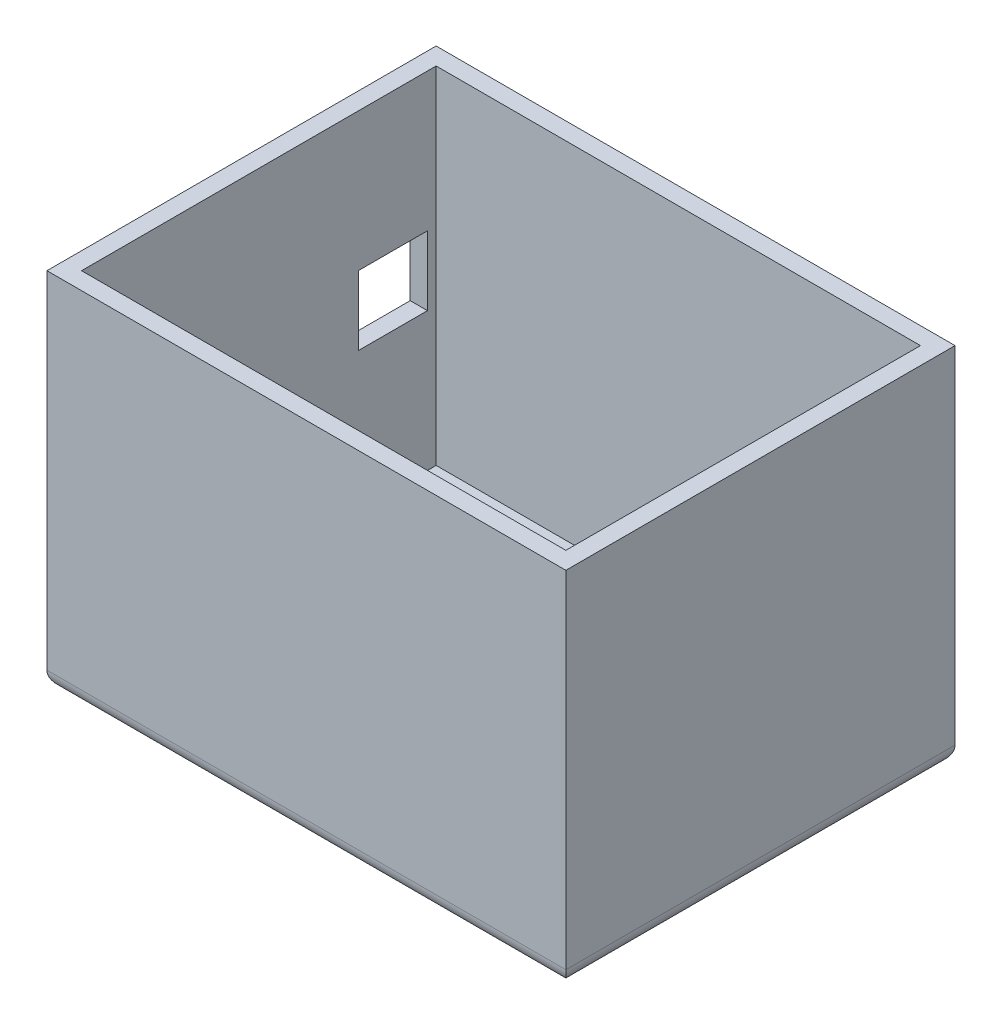
ISO-10303-21;
HEADER;
FILE_DESCRIPTION(('STEP AP214'),'2;1');
FILE_NAME('part.step','',(''),(''),'','','');
FILE_SCHEMA(('AUTOMOTIVE_DESIGN { 1 0 10303 214 1 1 1 1 }'));
ENDSEC;
DATA;
#1=APPLICATION_CONTEXT('core data for automotive mechanical design processes');
#2=APPLICATION_PROTOCOL_DEFINITION('international standard','automotive_design',2000,#1);
#3=PRODUCT_CONTEXT('',#1,'mechanical');
#4=PRODUCT('Part','Part','',(#3));
#5=PRODUCT_RELATED_PRODUCT_CATEGORY('part','',(#4));
#6=PRODUCT_DEFINITION_FORMATION('','',#4);
#7=PRODUCT_DEFINITION_CONTEXT('part definition',#1,'design');
#8=PRODUCT_DEFINITION('design','',#6,#7);
#9=PRODUCT_DEFINITION_SHAPE('','',#8);
#10=(LENGTH_UNIT() NAMED_UNIT(*) SI_UNIT(.MILLI.,.METRE.));
#11=(NAMED_UNIT(*) PLANE_ANGLE_UNIT() SI_UNIT($,.RADIAN.));
#12=(NAMED_UNIT(*) SI_UNIT($,.STERADIAN.) SOLID_ANGLE_UNIT());
#13=UNCERTAINTY_MEASURE_WITH_UNIT(LENGTH_MEASURE(1.E-05),#10,'distance_accuracy_value','');
#14=(GEOMETRIC_REPRESENTATION_CONTEXT(3) GLOBAL_UNCERTAINTY_ASSIGNED_CONTEXT((#13)) GLOBAL_UNIT_ASSIGNED_CONTEXT((#10,
#11,#12)) REPRESENTATION_CONTEXT('',''));
#15=CARTESIAN_POINT('',(0.,0.,0.));
#16=DIRECTION('',(0.,0.,1.));
#17=DIRECTION('',(1.,0.,0.));
#18=AXIS2_PLACEMENT_3D('',#15,#16,#17);
#19=CARTESIAN_POINT('',(0.,400.,0.));
#20=DIRECTION('',(0.,1.,0.));
#21=DIRECTION('',(0.,0.,1.));
#22=AXIS2_PLACEMENT_3D('',#19,#20,#21);
#23=PLANE('',#22);
#24=DIRECTION('',(1.,0.,0.));
#25=VECTOR('',#24,1.);
#26=CARTESIAN_POINT('',(-300.,400.,225.));
#27=LINE('',#26,#25);
#28=CARTESIAN_POINT('',(-300.,400.,225.));
#29=VERTEX_POINT('',#28);
#30=CARTESIAN_POINT('',(300.,400.,225.));
#31=VERTEX_POINT('',#30);
#32=EDGE_CURVE('E259',#29,#31,#27,.T.);
#33=ORIENTED_EDGE('',*,*,#32,.T.);
#34=DIRECTION('',(0.,0.,-1.));
#35=VECTOR('',#34,1.);
#36=CARTESIAN_POINT('',(300.,400.,225.));
#37=LINE('',#36,#35);
#38=CARTESIAN_POINT('',(300.,400.,-225.));
#39=VERTEX_POINT('',#38);
#40=EDGE_CURVE('E262',#31,#39,#37,.T.);
#41=ORIENTED_EDGE('',*,*,#40,.T.);
#42=DIRECTION('',(-1.,0.,0.));
#43=VECTOR('',#42,1.);
#44=CARTESIAN_POINT('',(-300.,400.,-225.));
#45=LINE('',#44,#43);
#46=CARTESIAN_POINT('',(-300.,400.,-225.));
#47=VERTEX_POINT('',#46);
#48=EDGE_CURVE('E264',#39,#47,#45,.T.);
#49=ORIENTED_EDGE('',*,*,#48,.T.);
#50=DIRECTION('',(0.,0.,1.));
#51=VECTOR('',#50,1.);
#52=CARTESIAN_POINT('',(-300.,400.,225.));
#53=LINE('',#52,#51);
#54=EDGE_CURVE('E266',#47,#29,#53,.T.);
#55=ORIENTED_EDGE('',*,*,#54,.T.);
#56=EDGE_LOOP('',(#33,#41,#49,#55));
#57=FACE_BOUND('',#56,.T.);
#58=DIRECTION('',(-1.,0.,0.));
#59=VECTOR('',#58,1.);
#60=CARTESIAN_POINT('',(-280.,400.,-205.));
#61=LINE('',#60,#59);
#62=CARTESIAN_POINT('',(280.,400.,-205.));
#63=VERTEX_POINT('',#62);
#64=CARTESIAN_POINT('',(-280.,400.,-205.));
#65=VERTEX_POINT('',#64);
#66=EDGE_CURVE('E231',#63,#65,#61,.T.);
#67=ORIENTED_EDGE('',*,*,#66,.F.);
#68=DIRECTION('',(0.,0.,-1.));
#69=VECTOR('',#68,1.);
#70=CARTESIAN_POINT('',(280.,400.,205.));
#71=LINE('',#70,#69);
#72=CARTESIAN_POINT('',(280.,400.,205.));
#73=VERTEX_POINT('',#72);
#74=EDGE_CURVE('E229',#73,#63,#71,.T.);
#75=ORIENTED_EDGE('',*,*,#74,.F.);
#76=DIRECTION('',(1.,0.,0.));
#77=VECTOR('',#76,1.);
#78=CARTESIAN_POINT('',(-280.,400.,205.));
#79=LINE('',#78,#77);
#80=CARTESIAN_POINT('',(-280.,400.,205.));
#81=VERTEX_POINT('',#80);
#82=EDGE_CURVE('E237',#81,#73,#79,.T.);
#83=ORIENTED_EDGE('',*,*,#82,.F.);
#84=DIRECTION('',(0.,0.,1.));
#85=VECTOR('',#84,1.);
#86=CARTESIAN_POINT('',(-280.,400.,205.));
#87=LINE('',#86,#85);
#88=EDGE_CURVE('E234',#65,#81,#87,.T.);
#89=ORIENTED_EDGE('',*,*,#88,.F.);
#90=EDGE_LOOP('',(#67,#75,#83,#89));
#91=FACE_BOUND('',#90,.T.);
#92=ADVANCED_FACE('F33',(#57,#91),#23,.T.);
#93=CARTESIAN_POINT('',(-300.,400.,225.));
#94=DIRECTION('',(0.,0.,-1.));
#95=DIRECTION('',(-1.,0.,0.));
#96=AXIS2_PLACEMENT_3D('',#93,#94,#95);
#97=PLANE('',#96);
#98=DIRECTION('',(0.,-1.,0.));
#99=VECTOR('',#98,1.);
#100=CARTESIAN_POINT('',(-300.,400.,225.));
#101=LINE('',#100,#99);
#102=CARTESIAN_POINT('',(-300.,0.,225.));
#103=VERTEX_POINT('',#102);
#104=EDGE_CURVE('E268',#29,#103,#101,.T.);
#105=ORIENTED_EDGE('',*,*,#104,.T.);
#106=DIRECTION('',(-1.,0.,0.));
#107=VECTOR('',#106,1.);
#108=CARTESIAN_POINT('',(-300.,0.,225.));
#109=LINE('',#108,#107);
#110=CARTESIAN_POINT('',(300.,0.,225.));
#111=VERTEX_POINT('',#110);
#112=EDGE_CURVE('E42',#103,#111,#109,.F.);
#113=ORIENTED_EDGE('',*,*,#112,.T.);
#114=DIRECTION('',(0.,-1.,0.));
#115=VECTOR('',#114,1.);
#116=CARTESIAN_POINT('',(300.,400.,225.));
#117=LINE('',#116,#115);
#118=EDGE_CURVE('E277',#31,#111,#117,.T.);
#119=ORIENTED_EDGE('',*,*,#118,.F.);
#120=ORIENTED_EDGE('',*,*,#32,.F.);
#121=EDGE_LOOP('',(#105,#113,#119,#120));
#122=FACE_BOUND('',#121,.T.);
#123=ADVANCED_FACE('F315',(#122),#97,.F.);
#124=CARTESIAN_POINT('',(300.,400.,225.));
#125=DIRECTION('',(-1.,0.,0.));
#126=DIRECTION('',(0.,0.,1.));
#127=AXIS2_PLACEMENT_3D('',#124,#125,#126);
#128=PLANE('',#127);
#129=ORIENTED_EDGE('',*,*,#118,.T.);
#130=DIRECTION('',(0.,0.,1.));
#131=VECTOR('',#130,1.);
#132=CARTESIAN_POINT('',(300.,0.,225.));
#133=LINE('',#132,#131);
#134=CARTESIAN_POINT('',(300.,0.,-225.));
#135=VERTEX_POINT('',#134);
#136=EDGE_CURVE('E11',#111,#135,#133,.F.);
#137=ORIENTED_EDGE('',*,*,#136,.T.);
#138=DIRECTION('',(0.,-1.,0.));
#139=VECTOR('',#138,1.);
#140=CARTESIAN_POINT('',(300.,400.,-225.));
#141=LINE('',#140,#139);
#142=EDGE_CURVE('E274',#39,#135,#141,.T.);
#143=ORIENTED_EDGE('',*,*,#142,.F.);
#144=ORIENTED_EDGE('',*,*,#40,.F.);
#145=EDGE_LOOP('',(#129,#137,#143,#144));
#146=FACE_BOUND('',#145,.T.);
#147=ADVANCED_FACE('F319',(#146),#128,.F.);
#148=CARTESIAN_POINT('',(-300.,400.,-225.));
#149=DIRECTION('',(0.,0.,1.));
#150=DIRECTION('',(1.,0.,0.));
#151=AXIS2_PLACEMENT_3D('',#148,#149,#150);
#152=PLANE('',#151);
#153=ORIENTED_EDGE('',*,*,#142,.T.);
#154=DIRECTION('',(1.,0.,0.));
#155=VECTOR('',#154,1.);
#156=CARTESIAN_POINT('',(-300.,0.,-225.));
#157=LINE('',#156,#155);
#158=CARTESIAN_POINT('',(-300.,0.,-225.));
#159=VERTEX_POINT('',#158);
#160=EDGE_CURVE('E289',#135,#159,#157,.F.);
#161=ORIENTED_EDGE('',*,*,#160,.T.);
#162=DIRECTION('',(0.,-1.,0.));
#163=VECTOR('',#162,1.);
#164=CARTESIAN_POINT('',(-300.,400.,-225.));
#165=LINE('',#164,#163);
#166=EDGE_CURVE('E271',#47,#159,#165,.T.);
#167=ORIENTED_EDGE('',*,*,#166,.F.);
#168=ORIENTED_EDGE('',*,*,#48,.F.);
#169=EDGE_LOOP('',(#153,#161,#167,#168));
#170=FACE_BOUND('',#169,.T.);
#171=ADVANCED_FACE('F329',(#170),#152,.F.);
#172=CARTESIAN_POINT('',(-300.,400.,225.));
#173=DIRECTION('',(1.,0.,0.));
#174=DIRECTION('',(0.,0.,-1.));
#175=AXIS2_PLACEMENT_3D('',#172,#173,#174);
#176=PLANE('',#175);
#177=DIRECTION('',(0.,-1.,0.));
#178=VECTOR('',#177,1.);
#179=CARTESIAN_POINT('',(-300.,240.,-195.));
#180=LINE('',#179,#178);
#181=CARTESIAN_POINT('',(-300.,240.,-195.));
#182=VERTEX_POINT('',#181);
#183=CARTESIAN_POINT('',(-300.,160.,-195.));
#184=VERTEX_POINT('',#183);
#185=EDGE_CURVE('E183',#182,#184,#180,.T.);
#186=ORIENTED_EDGE('',*,*,#185,.F.);
#187=DIRECTION('',(0.,0.,-1.));
#188=VECTOR('',#187,1.);
#189=CARTESIAN_POINT('',(-300.,240.,-195.));
#190=LINE('',#189,#188);
#191=CARTESIAN_POINT('',(-300.,240.,-115.));
#192=VERTEX_POINT('',#191);
#193=EDGE_CURVE('E176',#192,#182,#190,.T.);
#194=ORIENTED_EDGE('',*,*,#193,.F.);
#195=DIRECTION('',(0.,1.,0.));
#196=VECTOR('',#195,1.);
#197=CARTESIAN_POINT('',(-300.,240.,-115.));
#198=LINE('',#197,#196);
#199=CARTESIAN_POINT('',(-300.,160.,-115.));
#200=VERTEX_POINT('',#199);
#201=EDGE_CURVE('E187',#200,#192,#198,.T.);
#202=ORIENTED_EDGE('',*,*,#201,.F.);
#203=DIRECTION('',(0.,0.,1.));
#204=VECTOR('',#203,1.);
#205=CARTESIAN_POINT('',(-300.,160.,-195.));
#206=LINE('',#205,#204);
#207=EDGE_CURVE('E50',#184,#200,#206,.T.);
#208=ORIENTED_EDGE('',*,*,#207,.F.);
#209=EDGE_LOOP('',(#186,#194,#202,#208));
#210=FACE_BOUND('',#209,.T.);
#211=DIRECTION('',(0.,-1.,0.));
#212=VECTOR('',#211,1.);
#213=CARTESIAN_POINT('',(-300.,240.,115.));
#214=LINE('',#213,#212);
#215=CARTESIAN_POINT('',(-300.,240.,115.));
#216=VERTEX_POINT('',#215);
#217=CARTESIAN_POINT('',(-300.,160.,115.));
#218=VERTEX_POINT('',#217);
#219=EDGE_CURVE('E200',#216,#218,#214,.T.);
#220=ORIENTED_EDGE('',*,*,#219,.F.);
#221=DIRECTION('',(0.,0.,-1.));
#222=VECTOR('',#221,1.);
#223=CARTESIAN_POINT('',(-300.,240.,115.));
#224=LINE('',#223,#222);
#225=CARTESIAN_POINT('',(-300.,240.,195.));
#226=VERTEX_POINT('',#225);
#227=EDGE_CURVE('E203',#226,#216,#224,.T.);
#228=ORIENTED_EDGE('',*,*,#227,.F.);
#229=DIRECTION('',(0.,1.,0.));
#230=VECTOR('',#229,1.);
#231=CARTESIAN_POINT('',(-300.,240.,195.));
#232=LINE('',#231,#230);
#233=CARTESIAN_POINT('',(-300.,160.,195.));
#234=VERTEX_POINT('',#233);
#235=EDGE_CURVE('E196',#234,#226,#232,.T.);
#236=ORIENTED_EDGE('',*,*,#235,.F.);
#237=DIRECTION('',(0.,0.,1.));
#238=VECTOR('',#237,1.);
#239=CARTESIAN_POINT('',(-300.,160.,115.));
#240=LINE('',#239,#238);
#241=EDGE_CURVE('E197',#218,#234,#240,.T.);
#242=ORIENTED_EDGE('',*,*,#241,.F.);
#243=EDGE_LOOP('',(#220,#228,#236,#242));
#244=FACE_BOUND('',#243,.T.);
#245=ORIENTED_EDGE('',*,*,#166,.T.);
#246=DIRECTION('',(0.,0.,-1.));
#247=VECTOR('',#246,1.);
#248=CARTESIAN_POINT('',(-300.,0.,225.));
#249=LINE('',#248,#247);
#250=EDGE_CURVE('E292',#159,#103,#249,.F.);
#251=ORIENTED_EDGE('',*,*,#250,.T.);
#252=ORIENTED_EDGE('',*,*,#104,.F.);
#253=ORIENTED_EDGE('',*,*,#54,.F.);
#254=EDGE_LOOP('',(#245,#251,#252,#253));
#255=FACE_BOUND('',#254,.T.);
#256=ADVANCED_FACE('F327',(#210,#244,#255),#176,.F.);
#257=CARTESIAN_POINT('',(280.,400.,205.));
#258=DIRECTION('',(-1.,0.,0.));
#259=DIRECTION('',(0.,0.,1.));
#260=AXIS2_PLACEMENT_3D('',#257,#258,#259);
#261=PLANE('',#260);
#262=DIRECTION('',(0.,0.,-1.));
#263=VECTOR('',#262,1.);
#264=CARTESIAN_POINT('',(280.,0.,205.));
#265=LINE('',#264,#263);
#266=CARTESIAN_POINT('',(280.,0.,205.));
#267=VERTEX_POINT('',#266);
#268=CARTESIAN_POINT('',(280.,0.,-205.));
#269=VERTEX_POINT('',#268);
#270=EDGE_CURVE('E240',#267,#269,#265,.T.);
#271=ORIENTED_EDGE('',*,*,#270,.F.);
#272=DIRECTION('',(0.,-1.,0.));
#273=VECTOR('',#272,1.);
#274=CARTESIAN_POINT('',(280.,400.,205.));
#275=LINE('',#274,#273);
#276=EDGE_CURVE('E239',#73,#267,#275,.T.);
#277=ORIENTED_EDGE('',*,*,#276,.F.);
#278=ORIENTED_EDGE('',*,*,#74,.T.);
#279=DIRECTION('',(0.,-1.,0.));
#280=VECTOR('',#279,1.);
#281=CARTESIAN_POINT('',(280.,400.,-205.));
#282=LINE('',#281,#280);
#283=EDGE_CURVE('E256',#63,#269,#282,.T.);
#284=ORIENTED_EDGE('',*,*,#283,.T.);
#285=EDGE_LOOP('',(#271,#277,#278,#284));
#286=FACE_BOUND('',#285,.T.);
#287=ADVANCED_FACE('F360',(#286),#261,.T.);
#288=CARTESIAN_POINT('',(-280.,400.,-205.));
#289=DIRECTION('',(0.,0.,1.));
#290=DIRECTION('',(1.,0.,0.));
#291=AXIS2_PLACEMENT_3D('',#288,#289,#290);
#292=PLANE('',#291);
#293=DIRECTION('',(-1.,0.,0.));
#294=VECTOR('',#293,1.);
#295=CARTESIAN_POINT('',(-280.,0.,-205.));
#296=LINE('',#295,#294);
#297=CARTESIAN_POINT('',(-280.,0.,-205.));
#298=VERTEX_POINT('',#297);
#299=EDGE_CURVE('E243',#269,#298,#296,.T.);
#300=ORIENTED_EDGE('',*,*,#299,.F.);
#301=ORIENTED_EDGE('',*,*,#283,.F.);
#302=ORIENTED_EDGE('',*,*,#66,.T.);
#303=DIRECTION('',(0.,-1.,0.));
#304=VECTOR('',#303,1.);
#305=CARTESIAN_POINT('',(-280.,400.,-205.));
#306=LINE('',#305,#304);
#307=EDGE_CURVE('E254',#65,#298,#306,.T.);
#308=ORIENTED_EDGE('',*,*,#307,.T.);
#309=EDGE_LOOP('',(#300,#301,#302,#308));
#310=FACE_BOUND('',#309,.T.);
#311=ADVANCED_FACE('F526',(#310),#292,.T.);
#312=CARTESIAN_POINT('',(-280.,400.,205.));
#313=DIRECTION('',(1.,0.,0.));
#314=DIRECTION('',(0.,0.,-1.));
#315=AXIS2_PLACEMENT_3D('',#312,#313,#314);
#316=PLANE('',#315);
#317=DIRECTION('',(0.,0.,-1.));
#318=VECTOR('',#317,1.);
#319=CARTESIAN_POINT('',(-280.,240.,-195.));
#320=LINE('',#319,#318);
#321=CARTESIAN_POINT('',(-280.,240.,-115.));
#322=VERTEX_POINT('',#321);
#323=CARTESIAN_POINT('',(-280.,240.,-195.));
#324=VERTEX_POINT('',#323);
#325=EDGE_CURVE('E173',#322,#324,#320,.T.);
#326=ORIENTED_EDGE('',*,*,#325,.T.);
#327=DIRECTION('',(0.,-1.,0.));
#328=VECTOR('',#327,1.);
#329=CARTESIAN_POINT('',(-280.,240.,-195.));
#330=LINE('',#329,#328);
#331=CARTESIAN_POINT('',(-280.,160.,-195.));
#332=VERTEX_POINT('',#331);
#333=EDGE_CURVE('E160',#324,#332,#330,.T.);
#334=ORIENTED_EDGE('',*,*,#333,.T.);
#335=DIRECTION('',(0.,0.,1.));
#336=VECTOR('',#335,1.);
#337=CARTESIAN_POINT('',(-280.,160.,-195.));
#338=LINE('',#337,#336);
#339=CARTESIAN_POINT('',(-280.,160.,-115.));
#340=VERTEX_POINT('',#339);
#341=EDGE_CURVE('E191',#332,#340,#338,.T.);
#342=ORIENTED_EDGE('',*,*,#341,.T.);
#343=DIRECTION('',(0.,1.,0.));
#344=VECTOR('',#343,1.);
#345=CARTESIAN_POINT('',(-280.,240.,-115.));
#346=LINE('',#345,#344);
#347=EDGE_CURVE('E181',#340,#322,#346,.T.);
#348=ORIENTED_EDGE('',*,*,#347,.T.);
#349=EDGE_LOOP('',(#326,#334,#342,#348));
#350=FACE_BOUND('',#349,.T.);
#351=DIRECTION('',(0.,0.,-1.));
#352=VECTOR('',#351,1.);
#353=CARTESIAN_POINT('',(-280.,240.,115.));
#354=LINE('',#353,#352);
#355=CARTESIAN_POINT('',(-280.,240.,195.));
#356=VERTEX_POINT('',#355);
#357=CARTESIAN_POINT('',(-280.,240.,115.));
#358=VERTEX_POINT('',#357);
#359=EDGE_CURVE('E199',#356,#358,#354,.T.);
#360=ORIENTED_EDGE('',*,*,#359,.T.);
#361=DIRECTION('',(0.,-1.,0.));
#362=VECTOR('',#361,1.);
#363=CARTESIAN_POINT('',(-280.,240.,115.));
#364=LINE('',#363,#362);
#365=CARTESIAN_POINT('',(-280.,160.,115.));
#366=VERTEX_POINT('',#365);
#367=EDGE_CURVE('E220',#358,#366,#364,.T.);
#368=ORIENTED_EDGE('',*,*,#367,.T.);
#369=DIRECTION('',(0.,0.,1.));
#370=VECTOR('',#369,1.);
#371=CARTESIAN_POINT('',(-280.,160.,115.));
#372=LINE('',#371,#370);
#373=CARTESIAN_POINT('',(-280.,160.,195.));
#374=VERTEX_POINT('',#373);
#375=EDGE_CURVE('E216',#366,#374,#372,.T.);
#376=ORIENTED_EDGE('',*,*,#375,.T.);
#377=DIRECTION('',(0.,1.,0.));
#378=VECTOR('',#377,1.);
#379=CARTESIAN_POINT('',(-280.,240.,195.));
#380=LINE('',#379,#378);
#381=EDGE_CURVE('E211',#374,#356,#380,.T.);
#382=ORIENTED_EDGE('',*,*,#381,.T.);
#383=EDGE_LOOP('',(#360,#368,#376,#382));
#384=FACE_BOUND('',#383,.T.);
#385=DIRECTION('',(0.,0.,1.));
#386=VECTOR('',#385,1.);
#387=CARTESIAN_POINT('',(-280.,0.,205.));
#388=LINE('',#387,#386);
#389=CARTESIAN_POINT('',(-280.,0.,205.));
#390=VERTEX_POINT('',#389);
#391=EDGE_CURVE('E246',#298,#390,#388,.T.);
#392=ORIENTED_EDGE('',*,*,#391,.F.);
#393=ORIENTED_EDGE('',*,*,#307,.F.);
#394=ORIENTED_EDGE('',*,*,#88,.T.);
#395=DIRECTION('',(0.,-1.,0.));
#396=VECTOR('',#395,1.);
#397=CARTESIAN_POINT('',(-280.,400.,205.));
#398=LINE('',#397,#396);
#399=EDGE_CURVE('E252',#81,#390,#398,.T.);
#400=ORIENTED_EDGE('',*,*,#399,.T.);
#401=EDGE_LOOP('',(#392,#393,#394,#400));
#402=FACE_BOUND('',#401,.T.);
#403=ADVANCED_FACE('F179',(#350,#384,#402),#316,.T.);
#404=CARTESIAN_POINT('',(-280.,400.,205.));
#405=DIRECTION('',(0.,0.,-1.));
#406=DIRECTION('',(-1.,0.,0.));
#407=AXIS2_PLACEMENT_3D('',#404,#405,#406);
#408=PLANE('',#407);
#409=DIRECTION('',(1.,0.,0.));
#410=VECTOR('',#409,1.);
#411=CARTESIAN_POINT('',(-280.,0.,205.));
#412=LINE('',#411,#410);
#413=EDGE_CURVE('E232',#390,#267,#412,.T.);
#414=ORIENTED_EDGE('',*,*,#413,.F.);
#415=ORIENTED_EDGE('',*,*,#399,.F.);
#416=ORIENTED_EDGE('',*,*,#82,.T.);
#417=ORIENTED_EDGE('',*,*,#276,.T.);
#418=EDGE_LOOP('',(#414,#415,#416,#417));
#419=FACE_BOUND('',#418,.T.);
#420=ADVANCED_FACE('F347',(#419),#408,.T.);
#421=CARTESIAN_POINT('',(0.,0.,0.));
#422=DIRECTION('',(0.,1.,0.));
#423=DIRECTION('',(0.,0.,1.));
#424=AXIS2_PLACEMENT_3D('',#421,#422,#423);
#425=PLANE('',#424);
#426=ORIENTED_EDGE('',*,*,#413,.T.);
#427=ORIENTED_EDGE('',*,*,#270,.T.);
#428=ORIENTED_EDGE('',*,*,#299,.T.);
#429=ORIENTED_EDGE('',*,*,#391,.T.);
#430=EDGE_LOOP('',(#426,#427,#428,#429));
#431=FACE_BOUND('',#430,.T.);
#432=ADVANCED_FACE('F339',(#431),#425,.T.);
#433=CARTESIAN_POINT('',(0.,-20.,0.));
#434=DIRECTION('',(0.,1.,0.));
#435=DIRECTION('',(0.,0.,1.));
#436=AXIS2_PLACEMENT_3D('',#433,#434,#435);
#437=PLANE('',#436);
#438=DIRECTION('',(0.,0.,-1.));
#439=VECTOR('',#438,1.);
#440=CARTESIAN_POINT('',(-280.,-20.,0.));
#441=LINE('',#440,#439);
#442=CARTESIAN_POINT('',(-280.,-20.,205.));
#443=VERTEX_POINT('',#442);
#444=CARTESIAN_POINT('',(-280.,-20.,-205.));
#445=VERTEX_POINT('',#444);
#446=EDGE_CURVE('E284',#443,#445,#441,.T.);
#447=ORIENTED_EDGE('',*,*,#446,.T.);
#448=DIRECTION('',(1.,0.,0.));
#449=VECTOR('',#448,1.);
#450=CARTESIAN_POINT('',(0.,-20.,-205.));
#451=LINE('',#450,#449);
#452=CARTESIAN_POINT('',(280.,-20.,-205.));
#453=VERTEX_POINT('',#452);
#454=EDGE_CURVE('E286',#445,#453,#451,.T.);
#455=ORIENTED_EDGE('',*,*,#454,.T.);
#456=DIRECTION('',(0.,0.,1.));
#457=VECTOR('',#456,1.);
#458=CARTESIAN_POINT('',(280.,-20.,0.));
#459=LINE('',#458,#457);
#460=CARTESIAN_POINT('',(280.,-20.,205.));
#461=VERTEX_POINT('',#460);
#462=EDGE_CURVE('E280',#453,#461,#459,.T.);
#463=ORIENTED_EDGE('',*,*,#462,.T.);
#464=DIRECTION('',(-1.,0.,0.));
#465=VECTOR('',#464,1.);
#466=CARTESIAN_POINT('',(0.,-20.,205.));
#467=LINE('',#466,#465);
#468=EDGE_CURVE('E282',#461,#443,#467,.T.);
#469=ORIENTED_EDGE('',*,*,#468,.T.);
#470=EDGE_LOOP('',(#447,#455,#463,#469));
#471=FACE_BOUND('',#470,.T.);
#472=ADVANCED_FACE('F337',(#471),#437,.F.);
#473=CARTESIAN_POINT('',(0.,0.,205.));
#474=DIRECTION('',(-1.,0.,0.));
#475=DIRECTION('',(0.,0.,1.));
#476=AXIS2_PLACEMENT_3D('',#473,#474,#475);
#477=CYLINDRICAL_SURFACE('',#476,20.);
#478=CARTESIAN_POINT('',(280.,0.,205.));
#479=DIRECTION('',(-0.707106781186547,0.,0.707106781186547));
#480=DIRECTION('',(0.707106781186547,0.,0.707106781186547));
#481=AXIS2_PLACEMENT_3D('',#478,#479,#480);
#482=ELLIPSE('',#481,28.2842712474619,20.);
#483=EDGE_CURVE('E297',#111,#461,#482,.F.);
#484=ORIENTED_EDGE('',*,*,#483,.F.);
#485=ORIENTED_EDGE('',*,*,#112,.F.);
#486=CARTESIAN_POINT('',(-280.,0.,205.));
#487=DIRECTION('',(-0.707106781186547,0.,-0.707106781186547));
#488=DIRECTION('',(-0.707106781186547,0.,0.707106781186547));
#489=AXIS2_PLACEMENT_3D('',#486,#487,#488);
#490=ELLIPSE('',#489,28.2842712474619,20.);
#491=EDGE_CURVE('E37',#443,#103,#490,.T.);
#492=ORIENTED_EDGE('',*,*,#491,.F.);
#493=ORIENTED_EDGE('',*,*,#468,.F.);
#494=EDGE_LOOP('',(#484,#485,#492,#493));
#495=FACE_BOUND('',#494,.T.);
#496=ADVANCED_FACE('F35',(#495),#477,.T.);
#497=CARTESIAN_POINT('',(-280.,0.,0.));
#498=DIRECTION('',(0.,0.,-1.));
#499=DIRECTION('',(-1.,0.,0.));
#500=AXIS2_PLACEMENT_3D('',#497,#498,#499);
#501=CYLINDRICAL_SURFACE('',#500,20.);
#502=ORIENTED_EDGE('',*,*,#491,.T.);
#503=ORIENTED_EDGE('',*,*,#250,.F.);
#504=CARTESIAN_POINT('',(-280.,0.,-205.));
#505=DIRECTION('',(0.707106781186547,0.,-0.707106781186547));
#506=DIRECTION('',(-0.707106781186547,0.,-0.707106781186547));
#507=AXIS2_PLACEMENT_3D('',#504,#505,#506);
#508=ELLIPSE('',#507,28.2842712474619,20.);
#509=EDGE_CURVE('E296',#445,#159,#508,.T.);
#510=ORIENTED_EDGE('',*,*,#509,.F.);
#511=ORIENTED_EDGE('',*,*,#446,.F.);
#512=EDGE_LOOP('',(#502,#503,#510,#511));
#513=FACE_BOUND('',#512,.T.);
#514=ADVANCED_FACE('F308',(#513),#501,.T.);
#515=CARTESIAN_POINT('',(280.,0.,0.));
#516=DIRECTION('',(0.,0.,1.));
#517=DIRECTION('',(1.,0.,0.));
#518=AXIS2_PLACEMENT_3D('',#515,#516,#517);
#519=CYLINDRICAL_SURFACE('',#518,20.);
#520=ORIENTED_EDGE('',*,*,#483,.T.);
#521=ORIENTED_EDGE('',*,*,#462,.F.);
#522=CARTESIAN_POINT('',(280.,0.,-205.));
#523=DIRECTION('',(0.707106781186547,0.,0.707106781186547));
#524=DIRECTION('',(-0.707106781186547,0.,0.707106781186547));
#525=AXIS2_PLACEMENT_3D('',#522,#523,#524);
#526=ELLIPSE('',#525,28.2842712474619,20.);
#527=EDGE_CURVE('E228',#135,#453,#526,.F.);
#528=ORIENTED_EDGE('',*,*,#527,.F.);
#529=ORIENTED_EDGE('',*,*,#136,.F.);
#530=EDGE_LOOP('',(#520,#521,#528,#529));
#531=FACE_BOUND('',#530,.T.);
#532=ADVANCED_FACE('F335',(#531),#519,.T.);
#533=CARTESIAN_POINT('',(0.,0.,-205.));
#534=DIRECTION('',(1.,0.,0.));
#535=DIRECTION('',(0.,0.,-1.));
#536=AXIS2_PLACEMENT_3D('',#533,#534,#535);
#537=CYLINDRICAL_SURFACE('',#536,20.);
#538=ORIENTED_EDGE('',*,*,#509,.T.);
#539=ORIENTED_EDGE('',*,*,#160,.F.);
#540=ORIENTED_EDGE('',*,*,#527,.T.);
#541=ORIENTED_EDGE('',*,*,#454,.F.);
#542=EDGE_LOOP('',(#538,#539,#540,#541));
#543=FACE_BOUND('',#542,.T.);
#544=ADVANCED_FACE('F333',(#543),#537,.T.);
#545=CARTESIAN_POINT('',(-166.862915010152,240.,115.));
#546=DIRECTION('',(0.,1.,0.));
#547=DIRECTION('',(0.,0.,1.));
#548=AXIS2_PLACEMENT_3D('',#545,#546,#547);
#549=PLANE('',#548);
#550=DIRECTION('',(-1.,0.,0.));
#551=VECTOR('',#550,1.);
#552=CARTESIAN_POINT('',(-166.862915010152,240.,195.));
#553=LINE('',#552,#551);
#554=EDGE_CURVE('E214',#356,#226,#553,.T.);
#555=ORIENTED_EDGE('',*,*,#554,.T.);
#556=ORIENTED_EDGE('',*,*,#227,.T.);
#557=DIRECTION('',(-1.,0.,0.));
#558=VECTOR('',#557,1.);
#559=CARTESIAN_POINT('',(-166.862915010152,240.,115.));
#560=LINE('',#559,#558);
#561=EDGE_CURVE('E210',#358,#216,#560,.T.);
#562=ORIENTED_EDGE('',*,*,#561,.F.);
#563=ORIENTED_EDGE('',*,*,#359,.F.);
#564=EDGE_LOOP('',(#555,#556,#562,#563));
#565=FACE_BOUND('',#564,.T.);
#566=ADVANCED_FACE('F370',(#565),#549,.F.);
#567=CARTESIAN_POINT('',(-166.862915010152,240.,115.));
#568=DIRECTION('',(0.,0.,-1.));
#569=DIRECTION('',(-1.,0.,0.));
#570=AXIS2_PLACEMENT_3D('',#567,#568,#569);
#571=PLANE('',#570);
#572=ORIENTED_EDGE('',*,*,#561,.T.);
#573=ORIENTED_EDGE('',*,*,#219,.T.);
#574=DIRECTION('',(-1.,0.,0.));
#575=VECTOR('',#574,1.);
#576=CARTESIAN_POINT('',(-166.862915010152,160.,115.));
#577=LINE('',#576,#575);
#578=EDGE_CURVE('E219',#366,#218,#577,.T.);
#579=ORIENTED_EDGE('',*,*,#578,.F.);
#580=ORIENTED_EDGE('',*,*,#367,.F.);
#581=EDGE_LOOP('',(#572,#573,#579,#580));
#582=FACE_BOUND('',#581,.T.);
#583=ADVANCED_FACE('F390',(#582),#571,.F.);
#584=CARTESIAN_POINT('',(-166.862915010152,160.,115.));
#585=DIRECTION('',(0.,-1.,0.));
#586=DIRECTION('',(0.,0.,-1.));
#587=AXIS2_PLACEMENT_3D('',#584,#585,#586);
#588=PLANE('',#587);
#589=ORIENTED_EDGE('',*,*,#578,.T.);
#590=ORIENTED_EDGE('',*,*,#241,.T.);
#591=DIRECTION('',(-1.,0.,0.));
#592=VECTOR('',#591,1.);
#593=CARTESIAN_POINT('',(-166.862915010152,160.,195.));
#594=LINE('',#593,#592);
#595=EDGE_CURVE('E215',#374,#234,#594,.T.);
#596=ORIENTED_EDGE('',*,*,#595,.F.);
#597=ORIENTED_EDGE('',*,*,#375,.F.);
#598=EDGE_LOOP('',(#589,#590,#596,#597));
#599=FACE_BOUND('',#598,.T.);
#600=ADVANCED_FACE('F398',(#599),#588,.F.);
#601=CARTESIAN_POINT('',(-166.862915010152,240.,195.));
#602=DIRECTION('',(0.,0.,1.));
#603=DIRECTION('',(0.,-1.,0.));
#604=AXIS2_PLACEMENT_3D('',#601,#602,#603);
#605=PLANE('',#604);
#606=ORIENTED_EDGE('',*,*,#595,.T.);
#607=ORIENTED_EDGE('',*,*,#235,.T.);
#608=ORIENTED_EDGE('',*,*,#554,.F.);
#609=ORIENTED_EDGE('',*,*,#381,.F.);
#610=EDGE_LOOP('',(#606,#607,#608,#609));
#611=FACE_BOUND('',#610,.T.);
#612=ADVANCED_FACE('F406',(#611),#605,.F.);
#613=CARTESIAN_POINT('',(-166.862915010152,240.,-195.));
#614=DIRECTION('',(0.,1.,0.));
#615=DIRECTION('',(0.,0.,1.));
#616=AXIS2_PLACEMENT_3D('',#613,#614,#615);
#617=PLANE('',#616);
#618=DIRECTION('',(-1.,0.,0.));
#619=VECTOR('',#618,1.);
#620=CARTESIAN_POINT('',(-166.862915010152,240.,-115.));
#621=LINE('',#620,#619);
#622=EDGE_CURVE('E58',#322,#192,#621,.T.);
#623=ORIENTED_EDGE('',*,*,#622,.T.);
#624=ORIENTED_EDGE('',*,*,#193,.T.);
#625=DIRECTION('',(-1.,0.,0.));
#626=VECTOR('',#625,1.);
#627=CARTESIAN_POINT('',(-166.862915010152,240.,-195.));
#628=LINE('',#627,#626);
#629=EDGE_CURVE('E164',#324,#182,#628,.T.);
#630=ORIENTED_EDGE('',*,*,#629,.F.);
#631=ORIENTED_EDGE('',*,*,#325,.F.);
#632=EDGE_LOOP('',(#623,#624,#630,#631));
#633=FACE_BOUND('',#632,.T.);
#634=ADVANCED_FACE('F172',(#633),#617,.F.);
#635=CARTESIAN_POINT('',(-166.862915010152,240.,-195.));
#636=DIRECTION('',(0.,0.,-1.));
#637=DIRECTION('',(-1.,0.,0.));
#638=AXIS2_PLACEMENT_3D('',#635,#636,#637);
#639=PLANE('',#638);
#640=ORIENTED_EDGE('',*,*,#629,.T.);
#641=ORIENTED_EDGE('',*,*,#185,.T.);
#642=DIRECTION('',(-1.,0.,0.));
#643=VECTOR('',#642,1.);
#644=CARTESIAN_POINT('',(-166.862915010152,160.,-195.));
#645=LINE('',#644,#643);
#646=EDGE_CURVE('E166',#332,#184,#645,.T.);
#647=ORIENTED_EDGE('',*,*,#646,.F.);
#648=ORIENTED_EDGE('',*,*,#333,.F.);
#649=EDGE_LOOP('',(#640,#641,#647,#648));
#650=FACE_BOUND('',#649,.T.);
#651=ADVANCED_FACE('F162',(#650),#639,.F.);
#652=CARTESIAN_POINT('',(-166.862915010152,160.,-195.));
#653=DIRECTION('',(0.,-1.,0.));
#654=DIRECTION('',(0.,0.,-1.));
#655=AXIS2_PLACEMENT_3D('',#652,#653,#654);
#656=PLANE('',#655);
#657=ORIENTED_EDGE('',*,*,#646,.T.);
#658=ORIENTED_EDGE('',*,*,#207,.T.);
#659=DIRECTION('',(-1.,0.,0.));
#660=VECTOR('',#659,1.);
#661=CARTESIAN_POINT('',(-166.862915010152,160.,-115.));
#662=LINE('',#661,#660);
#663=EDGE_CURVE('E190',#340,#200,#662,.T.);
#664=ORIENTED_EDGE('',*,*,#663,.F.);
#665=ORIENTED_EDGE('',*,*,#341,.F.);
#666=EDGE_LOOP('',(#657,#658,#664,#665));
#667=FACE_BOUND('',#666,.T.);
#668=ADVANCED_FACE('F427',(#667),#656,.F.);
#669=CARTESIAN_POINT('',(-166.862915010152,240.,-115.));
#670=DIRECTION('',(0.,0.,1.));
#671=DIRECTION('',(0.,-1.,0.));
#672=AXIS2_PLACEMENT_3D('',#669,#670,#671);
#673=PLANE('',#672);
#674=ORIENTED_EDGE('',*,*,#663,.T.);
#675=ORIENTED_EDGE('',*,*,#201,.T.);
#676=ORIENTED_EDGE('',*,*,#622,.F.);
#677=ORIENTED_EDGE('',*,*,#347,.F.);
#678=EDGE_LOOP('',(#674,#675,#676,#677));
#679=FACE_BOUND('',#678,.T.);
#680=ADVANCED_FACE('F434',(#679),#673,.F.);
#681=CLOSED_SHELL('',(#92,#123,#147,#171,#256,#287,#311,#403,#420,#432,#472,#496,#514,#532,#544,
#566,#583,#600,#612,#634,#651,#668,#680));
#682=MANIFOLD_SOLID_BREP('B2',#681);
#683=ADVANCED_BREP_SHAPE_REPRESENTATION('',(#18,#682),#14);
#684=SHAPE_DEFINITION_REPRESENTATION(#9,#683);
ENDSEC;
END-ISO-10303-21;
